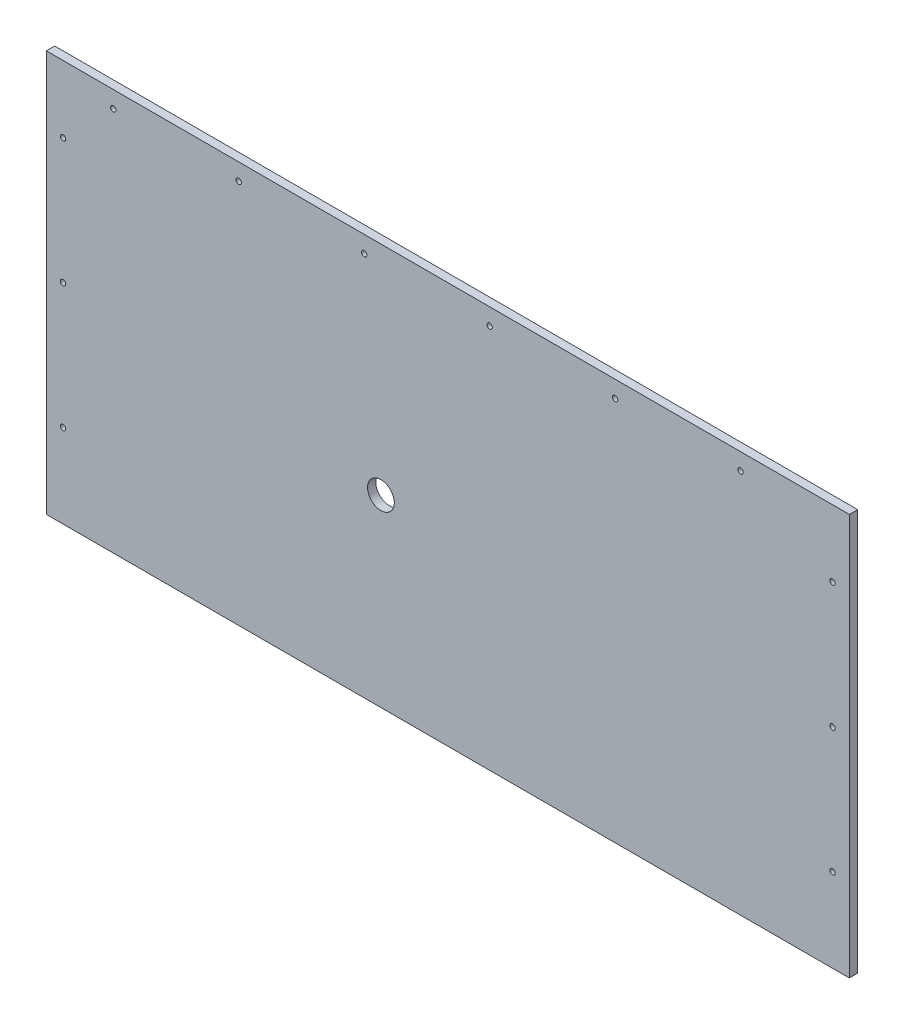
ISO-10303-21;
HEADER;
FILE_DESCRIPTION(('STEP AP214'),'2;1');
FILE_NAME('part.step','',(''),(''),'','','');
FILE_SCHEMA(('AUTOMOTIVE_DESIGN { 1 0 10303 214 1 1 1 1 }'));
ENDSEC;
DATA;
#1=APPLICATION_CONTEXT('core data for automotive mechanical design processes');
#2=APPLICATION_PROTOCOL_DEFINITION('international standard','automotive_design',2000,#1);
#3=PRODUCT_CONTEXT('',#1,'mechanical');
#4=PRODUCT('Part','Part','',(#3));
#5=PRODUCT_RELATED_PRODUCT_CATEGORY('part','',(#4));
#6=PRODUCT_DEFINITION_FORMATION('','',#4);
#7=PRODUCT_DEFINITION_CONTEXT('part definition',#1,'design');
#8=PRODUCT_DEFINITION('design','',#6,#7);
#9=PRODUCT_DEFINITION_SHAPE('','',#8);
#10=(LENGTH_UNIT() NAMED_UNIT(*) SI_UNIT(.MILLI.,.METRE.));
#11=(NAMED_UNIT(*) PLANE_ANGLE_UNIT() SI_UNIT($,.RADIAN.));
#12=(NAMED_UNIT(*) SI_UNIT($,.STERADIAN.) SOLID_ANGLE_UNIT());
#13=UNCERTAINTY_MEASURE_WITH_UNIT(LENGTH_MEASURE(1.E-05),#10,'distance_accuracy_value','');
#14=(GEOMETRIC_REPRESENTATION_CONTEXT(3) GLOBAL_UNCERTAINTY_ASSIGNED_CONTEXT((#13)) GLOBAL_UNIT_ASSIGNED_CONTEXT((#10,
#11,#12)) REPRESENTATION_CONTEXT('',''));
#15=CARTESIAN_POINT('',(0.,0.,0.));
#16=DIRECTION('',(0.,0.,1.));
#17=DIRECTION('',(1.,0.,0.));
#18=AXIS2_PLACEMENT_3D('',#15,#16,#17);
#19=CARTESIAN_POINT('',(0.,0.,6.35));
#20=DIRECTION('',(0.,0.,1.));
#21=DIRECTION('',(1.,0.,0.));
#22=AXIS2_PLACEMENT_3D('',#19,#20,#21);
#23=PLANE('',#22);
#24=CARTESIAN_POINT('',(254.,139.7,6.35));
#25=DIRECTION('',(0.,0.,-1.));
#26=DIRECTION('',(-1.,0.,0.));
#27=AXIS2_PLACEMENT_3D('',#24,#25,#26);
#28=CIRCLE('',#27,10.16);
#29=CARTESIAN_POINT('',(243.84,139.7,6.35));
#30=VERTEX_POINT('',#29);
#31=EDGE_CURVE('E154',#30,#30,#28,.T.);
#32=ORIENTED_EDGE('',*,*,#31,.T.);
#33=EDGE_LOOP('',(#32));
#34=FACE_BOUND('',#33,.T.);
#35=CARTESIAN_POINT('',(50.8,292.1,6.35));
#36=DIRECTION('',(0.,0.,1.));
#37=DIRECTION('',(1.,0.,0.));
#38=AXIS2_PLACEMENT_3D('',#35,#36,#37);
#39=CIRCLE('',#38,2.03200000000001);
#40=CARTESIAN_POINT('',(52.832,292.1,6.35));
#41=VERTEX_POINT('',#40);
#42=EDGE_CURVE('E181',#41,#41,#39,.T.);
#43=ORIENTED_EDGE('',*,*,#42,.F.);
#44=EDGE_LOOP('',(#43));
#45=FACE_BOUND('',#44,.T.);
#46=CARTESIAN_POINT('',(146.05,292.1,6.35));
#47=DIRECTION('',(0.,0.,1.));
#48=DIRECTION('',(1.,0.,0.));
#49=AXIS2_PLACEMENT_3D('',#46,#47,#48);
#50=CIRCLE('',#49,2.03200000000001);
#51=CARTESIAN_POINT('',(148.082,292.1,6.35));
#52=VERTEX_POINT('',#51);
#53=EDGE_CURVE('E175',#52,#52,#50,.T.);
#54=ORIENTED_EDGE('',*,*,#53,.F.);
#55=EDGE_LOOP('',(#54));
#56=FACE_BOUND('',#55,.T.);
#57=CARTESIAN_POINT('',(241.3,292.1,6.35));
#58=DIRECTION('',(0.,0.,1.));
#59=DIRECTION('',(1.,0.,0.));
#60=AXIS2_PLACEMENT_3D('',#57,#58,#59);
#61=CIRCLE('',#60,2.03199999999994);
#62=CARTESIAN_POINT('',(243.332,292.1,6.35));
#63=VERTEX_POINT('',#62);
#64=EDGE_CURVE('E169',#63,#63,#61,.T.);
#65=ORIENTED_EDGE('',*,*,#64,.F.);
#66=EDGE_LOOP('',(#65));
#67=FACE_BOUND('',#66,.T.);
#68=CARTESIAN_POINT('',(336.55,292.1,6.35));
#69=DIRECTION('',(0.,0.,1.));
#70=DIRECTION('',(1.,0.,0.));
#71=AXIS2_PLACEMENT_3D('',#68,#69,#70);
#72=CIRCLE('',#71,2.03199999999996);
#73=CARTESIAN_POINT('',(338.582,292.1,6.35));
#74=VERTEX_POINT('',#73);
#75=EDGE_CURVE('E163',#74,#74,#72,.T.);
#76=ORIENTED_EDGE('',*,*,#75,.F.);
#77=EDGE_LOOP('',(#76));
#78=FACE_BOUND('',#77,.T.);
#79=CARTESIAN_POINT('',(431.8,292.1,6.35));
#80=DIRECTION('',(0.,0.,1.));
#81=DIRECTION('',(1.,0.,0.));
#82=AXIS2_PLACEMENT_3D('',#79,#80,#81);
#83=CIRCLE('',#82,2.03199999999996);
#84=CARTESIAN_POINT('',(433.832,292.1,6.35));
#85=VERTEX_POINT('',#84);
#86=EDGE_CURVE('E157',#85,#85,#83,.T.);
#87=ORIENTED_EDGE('',*,*,#86,.F.);
#88=EDGE_LOOP('',(#87));
#89=FACE_BOUND('',#88,.T.);
#90=CARTESIAN_POINT('',(527.05,292.1,6.35));
#91=DIRECTION('',(0.,0.,1.));
#92=DIRECTION('',(1.,0.,0.));
#93=AXIS2_PLACEMENT_3D('',#90,#91,#92);
#94=CIRCLE('',#93,2.03200000000001);
#95=CARTESIAN_POINT('',(529.082,292.1,6.35));
#96=VERTEX_POINT('',#95);
#97=EDGE_CURVE('E150',#96,#96,#94,.T.);
#98=ORIENTED_EDGE('',*,*,#97,.F.);
#99=EDGE_LOOP('',(#98));
#100=FACE_BOUND('',#99,.T.);
#101=CARTESIAN_POINT('',(596.899999999999,158.75,6.35));
#102=DIRECTION('',(0.,0.,-1.));
#103=DIRECTION('',(-1.,0.,0.));
#104=AXIS2_PLACEMENT_3D('',#101,#102,#103);
#105=CIRCLE('',#104,2.03200000000001);
#106=CARTESIAN_POINT('',(594.867999999999,158.75,6.35));
#107=VERTEX_POINT('',#106);
#108=EDGE_CURVE('E130',#107,#107,#105,.T.);
#109=ORIENTED_EDGE('',*,*,#108,.T.);
#110=EDGE_LOOP('',(#109));
#111=FACE_BOUND('',#110,.T.);
#112=DIRECTION('',(1.,0.,0.));
#113=VECTOR('',#112,1.);
#114=CARTESIAN_POINT('',(0.,0.,6.35));
#115=LINE('',#114,#113);
#116=CARTESIAN_POINT('',(0.,0.,6.35));
#117=VERTEX_POINT('',#116);
#118=CARTESIAN_POINT('',(609.6,0.,6.35));
#119=VERTEX_POINT('',#118);
#120=EDGE_CURVE('E88',#117,#119,#115,.T.);
#121=ORIENTED_EDGE('',*,*,#120,.T.);
#122=DIRECTION('',(0.,1.,0.));
#123=VECTOR('',#122,1.);
#124=CARTESIAN_POINT('',(609.6,0.,6.35));
#125=LINE('',#124,#123);
#126=CARTESIAN_POINT('',(609.6,304.8,6.35));
#127=VERTEX_POINT('',#126);
#128=EDGE_CURVE('E80',#119,#127,#125,.T.);
#129=ORIENTED_EDGE('',*,*,#128,.T.);
#130=DIRECTION('',(1.,0.,0.));
#131=VECTOR('',#130,1.);
#132=CARTESIAN_POINT('',(0.,304.8,6.35));
#133=LINE('',#132,#131);
#134=CARTESIAN_POINT('',(0.,304.8,6.35));
#135=VERTEX_POINT('',#134);
#136=EDGE_CURVE('E87',#135,#127,#133,.T.);
#137=ORIENTED_EDGE('',*,*,#136,.F.);
#138=DIRECTION('',(0.,1.,0.));
#139=VECTOR('',#138,1.);
#140=CARTESIAN_POINT('',(0.,0.,6.35));
#141=LINE('',#140,#139);
#142=EDGE_CURVE('E97',#117,#135,#141,.T.);
#143=ORIENTED_EDGE('',*,*,#142,.F.);
#144=EDGE_LOOP('',(#121,#129,#137,#143));
#145=FACE_BOUND('',#144,.T.);
#146=CARTESIAN_POINT('',(12.7,254.,6.35));
#147=DIRECTION('',(0.,0.,1.));
#148=DIRECTION('',(1.,0.,0.));
#149=AXIS2_PLACEMENT_3D('',#146,#147,#148);
#150=CIRCLE('',#149,2.03200000000001);
#151=CARTESIAN_POINT('',(14.732,254.,6.35));
#152=VERTEX_POINT('',#151);
#153=EDGE_CURVE('E114',#152,#152,#150,.T.);
#154=ORIENTED_EDGE('',*,*,#153,.F.);
#155=EDGE_LOOP('',(#154));
#156=FACE_BOUND('',#155,.T.);
#157=CARTESIAN_POINT('',(12.700000000001,158.75,6.35));
#158=DIRECTION('',(0.,0.,1.));
#159=DIRECTION('',(1.,0.,0.));
#160=AXIS2_PLACEMENT_3D('',#157,#158,#159);
#161=CIRCLE('',#160,2.03199999999999);
#162=CARTESIAN_POINT('',(14.732000000001,158.75,6.35));
#163=VERTEX_POINT('',#162);
#164=EDGE_CURVE('E117',#163,#163,#161,.T.);
#165=ORIENTED_EDGE('',*,*,#164,.F.);
#166=EDGE_LOOP('',(#165));
#167=FACE_BOUND('',#166,.T.);
#168=CARTESIAN_POINT('',(12.700000000002,63.5,6.35));
#169=DIRECTION('',(0.,0.,1.));
#170=DIRECTION('',(1.,0.,0.));
#171=AXIS2_PLACEMENT_3D('',#168,#169,#170);
#172=CIRCLE('',#171,2.032);
#173=CARTESIAN_POINT('',(14.732000000002,63.5,6.35));
#174=VERTEX_POINT('',#173);
#175=EDGE_CURVE('E142',#174,#174,#172,.T.);
#176=ORIENTED_EDGE('',*,*,#175,.F.);
#177=EDGE_LOOP('',(#176));
#178=FACE_BOUND('',#177,.T.);
#179=CARTESIAN_POINT('',(596.899999999998,63.5000000000001,6.35));
#180=DIRECTION('',(0.,0.,-1.));
#181=DIRECTION('',(-1.,0.,0.));
#182=AXIS2_PLACEMENT_3D('',#179,#180,#181);
#183=CIRCLE('',#182,2.03200000000013);
#184=CARTESIAN_POINT('',(594.867999999998,63.5000000000001,6.35));
#185=VERTEX_POINT('',#184);
#186=EDGE_CURVE('E136',#185,#185,#183,.T.);
#187=ORIENTED_EDGE('',*,*,#186,.T.);
#188=EDGE_LOOP('',(#187));
#189=FACE_BOUND('',#188,.T.);
#190=CARTESIAN_POINT('',(596.9,254.,6.35));
#191=DIRECTION('',(0.,0.,-1.));
#192=DIRECTION('',(-1.,0.,0.));
#193=AXIS2_PLACEMENT_3D('',#190,#191,#192);
#194=CIRCLE('',#193,2.03200000000001);
#195=CARTESIAN_POINT('',(594.868,254.,6.35));
#196=VERTEX_POINT('',#195);
#197=EDGE_CURVE('E123',#196,#196,#194,.T.);
#198=ORIENTED_EDGE('',*,*,#197,.T.);
#199=EDGE_LOOP('',(#198));
#200=FACE_BOUND('',#199,.T.);
#201=ADVANCED_FACE('F38',(#34,#45,#56,#67,#78,#89,#100,#111,#145,#156,#167,#178,#189,#200),#23,.T.);
#202=CARTESIAN_POINT('',(0.,0.,0.));
#203=DIRECTION('',(0.,0.,1.));
#204=DIRECTION('',(1.,0.,0.));
#205=AXIS2_PLACEMENT_3D('',#202,#203,#204);
#206=PLANE('',#205);
#207=CARTESIAN_POINT('',(254.,139.7,0.));
#208=DIRECTION('',(0.,0.,-1.));
#209=DIRECTION('',(-1.,0.,0.));
#210=AXIS2_PLACEMENT_3D('',#207,#208,#209);
#211=CIRCLE('',#210,10.16);
#212=CARTESIAN_POINT('',(243.84,139.7,0.));
#213=VERTEX_POINT('',#212);
#214=EDGE_CURVE('E186',#213,#213,#211,.T.);
#215=ORIENTED_EDGE('',*,*,#214,.F.);
#216=EDGE_LOOP('',(#215));
#217=FACE_BOUND('',#216,.T.);
#218=CARTESIAN_POINT('',(50.8,292.1,0.));
#219=DIRECTION('',(0.,0.,1.));
#220=DIRECTION('',(1.,0.,0.));
#221=AXIS2_PLACEMENT_3D('',#218,#219,#220);
#222=CIRCLE('',#221,2.03200000000001);
#223=CARTESIAN_POINT('',(52.832,292.1,0.));
#224=VERTEX_POINT('',#223);
#225=EDGE_CURVE('E124',#224,#224,#222,.T.);
#226=ORIENTED_EDGE('',*,*,#225,.T.);
#227=EDGE_LOOP('',(#226));
#228=FACE_BOUND('',#227,.T.);
#229=CARTESIAN_POINT('',(146.05,292.1,0.));
#230=DIRECTION('',(0.,0.,1.));
#231=DIRECTION('',(1.,0.,0.));
#232=AXIS2_PLACEMENT_3D('',#229,#230,#231);
#233=CIRCLE('',#232,2.03200000000001);
#234=CARTESIAN_POINT('',(148.082,292.1,0.));
#235=VERTEX_POINT('',#234);
#236=EDGE_CURVE('E178',#235,#235,#233,.T.);
#237=ORIENTED_EDGE('',*,*,#236,.T.);
#238=EDGE_LOOP('',(#237));
#239=FACE_BOUND('',#238,.T.);
#240=CARTESIAN_POINT('',(241.3,292.1,0.));
#241=DIRECTION('',(0.,0.,1.));
#242=DIRECTION('',(1.,0.,0.));
#243=AXIS2_PLACEMENT_3D('',#240,#241,#242);
#244=CIRCLE('',#243,2.03199999999994);
#245=CARTESIAN_POINT('',(243.332,292.1,0.));
#246=VERTEX_POINT('',#245);
#247=EDGE_CURVE('E172',#246,#246,#244,.T.);
#248=ORIENTED_EDGE('',*,*,#247,.T.);
#249=EDGE_LOOP('',(#248));
#250=FACE_BOUND('',#249,.T.);
#251=CARTESIAN_POINT('',(336.55,292.1,0.));
#252=DIRECTION('',(0.,0.,1.));
#253=DIRECTION('',(1.,0.,0.));
#254=AXIS2_PLACEMENT_3D('',#251,#252,#253);
#255=CIRCLE('',#254,2.03199999999996);
#256=CARTESIAN_POINT('',(338.582,292.1,0.));
#257=VERTEX_POINT('',#256);
#258=EDGE_CURVE('E166',#257,#257,#255,.T.);
#259=ORIENTED_EDGE('',*,*,#258,.T.);
#260=EDGE_LOOP('',(#259));
#261=FACE_BOUND('',#260,.T.);
#262=CARTESIAN_POINT('',(431.8,292.1,0.));
#263=DIRECTION('',(0.,0.,1.));
#264=DIRECTION('',(1.,0.,0.));
#265=AXIS2_PLACEMENT_3D('',#262,#263,#264);
#266=CIRCLE('',#265,2.03199999999996);
#267=CARTESIAN_POINT('',(433.832,292.1,0.));
#268=VERTEX_POINT('',#267);
#269=EDGE_CURVE('E160',#268,#268,#266,.T.);
#270=ORIENTED_EDGE('',*,*,#269,.T.);
#271=EDGE_LOOP('',(#270));
#272=FACE_BOUND('',#271,.T.);
#273=CARTESIAN_POINT('',(527.05,292.1,0.));
#274=DIRECTION('',(0.,0.,1.));
#275=DIRECTION('',(1.,0.,0.));
#276=AXIS2_PLACEMENT_3D('',#273,#274,#275);
#277=CIRCLE('',#276,2.03200000000001);
#278=CARTESIAN_POINT('',(529.082,292.1,0.));
#279=VERTEX_POINT('',#278);
#280=EDGE_CURVE('E153',#279,#279,#277,.T.);
#281=ORIENTED_EDGE('',*,*,#280,.T.);
#282=EDGE_LOOP('',(#281));
#283=FACE_BOUND('',#282,.T.);
#284=CARTESIAN_POINT('',(12.700000000002,63.5,0.));
#285=DIRECTION('',(0.,0.,1.));
#286=DIRECTION('',(1.,0.,0.));
#287=AXIS2_PLACEMENT_3D('',#284,#285,#286);
#288=CIRCLE('',#287,2.032);
#289=CARTESIAN_POINT('',(14.732000000002,63.5,0.));
#290=VERTEX_POINT('',#289);
#291=EDGE_CURVE('E139',#290,#290,#288,.T.);
#292=ORIENTED_EDGE('',*,*,#291,.T.);
#293=EDGE_LOOP('',(#292));
#294=FACE_BOUND('',#293,.T.);
#295=CARTESIAN_POINT('',(12.700000000001,158.75,0.));
#296=DIRECTION('',(0.,0.,1.));
#297=DIRECTION('',(1.,0.,0.));
#298=AXIS2_PLACEMENT_3D('',#295,#296,#297);
#299=CIRCLE('',#298,2.03199999999999);
#300=CARTESIAN_POINT('',(14.732000000001,158.75,0.));
#301=VERTEX_POINT('',#300);
#302=EDGE_CURVE('E145',#301,#301,#299,.T.);
#303=ORIENTED_EDGE('',*,*,#302,.T.);
#304=EDGE_LOOP('',(#303));
#305=FACE_BOUND('',#304,.T.);
#306=CARTESIAN_POINT('',(12.7,254.,0.));
#307=DIRECTION('',(0.,0.,1.));
#308=DIRECTION('',(1.,0.,0.));
#309=AXIS2_PLACEMENT_3D('',#306,#307,#308);
#310=CIRCLE('',#309,2.03200000000001);
#311=CARTESIAN_POINT('',(14.732,254.,0.));
#312=VERTEX_POINT('',#311);
#313=EDGE_CURVE('E104',#312,#312,#310,.T.);
#314=ORIENTED_EDGE('',*,*,#313,.T.);
#315=EDGE_LOOP('',(#314));
#316=FACE_BOUND('',#315,.T.);
#317=DIRECTION('',(1.,0.,0.));
#318=VECTOR('',#317,1.);
#319=CARTESIAN_POINT('',(0.,0.,0.));
#320=LINE('',#319,#318);
#321=CARTESIAN_POINT('',(0.,0.,0.));
#322=VERTEX_POINT('',#321);
#323=CARTESIAN_POINT('',(609.6,0.,0.));
#324=VERTEX_POINT('',#323);
#325=EDGE_CURVE('E102',#322,#324,#320,.T.);
#326=ORIENTED_EDGE('',*,*,#325,.F.);
#327=DIRECTION('',(0.,1.,0.));
#328=VECTOR('',#327,1.);
#329=CARTESIAN_POINT('',(0.,0.,0.));
#330=LINE('',#329,#328);
#331=CARTESIAN_POINT('',(0.,304.8,0.));
#332=VERTEX_POINT('',#331);
#333=EDGE_CURVE('E108',#322,#332,#330,.T.);
#334=ORIENTED_EDGE('',*,*,#333,.T.);
#335=DIRECTION('',(1.,0.,0.));
#336=VECTOR('',#335,1.);
#337=CARTESIAN_POINT('',(0.,304.8,0.));
#338=LINE('',#337,#336);
#339=CARTESIAN_POINT('',(609.6,304.8,0.));
#340=VERTEX_POINT('',#339);
#341=EDGE_CURVE('E106',#332,#340,#338,.T.);
#342=ORIENTED_EDGE('',*,*,#341,.T.);
#343=DIRECTION('',(0.,1.,0.));
#344=VECTOR('',#343,1.);
#345=CARTESIAN_POINT('',(609.6,0.,0.));
#346=LINE('',#345,#344);
#347=EDGE_CURVE('E93',#324,#340,#346,.T.);
#348=ORIENTED_EDGE('',*,*,#347,.F.);
#349=EDGE_LOOP('',(#326,#334,#342,#348));
#350=FACE_BOUND('',#349,.T.);
#351=CARTESIAN_POINT('',(596.899999999998,63.5000000000001,0.));
#352=DIRECTION('',(0.,0.,-1.));
#353=DIRECTION('',(-1.,0.,0.));
#354=AXIS2_PLACEMENT_3D('',#351,#352,#353);
#355=CIRCLE('',#354,2.03200000000013);
#356=CARTESIAN_POINT('',(594.867999999998,63.5000000000001,0.));
#357=VERTEX_POINT('',#356);
#358=EDGE_CURVE('E133',#357,#357,#355,.T.);
#359=ORIENTED_EDGE('',*,*,#358,.F.);
#360=EDGE_LOOP('',(#359));
#361=FACE_BOUND('',#360,.T.);
#362=CARTESIAN_POINT('',(596.899999999999,158.75,0.));
#363=DIRECTION('',(0.,0.,-1.));
#364=DIRECTION('',(-1.,0.,0.));
#365=AXIS2_PLACEMENT_3D('',#362,#363,#364);
#366=CIRCLE('',#365,2.03200000000001);
#367=CARTESIAN_POINT('',(594.867999999999,158.75,0.));
#368=VERTEX_POINT('',#367);
#369=EDGE_CURVE('E127',#368,#368,#366,.T.);
#370=ORIENTED_EDGE('',*,*,#369,.F.);
#371=EDGE_LOOP('',(#370));
#372=FACE_BOUND('',#371,.T.);
#373=CARTESIAN_POINT('',(596.9,254.,0.));
#374=DIRECTION('',(0.,0.,-1.));
#375=DIRECTION('',(-1.,0.,0.));
#376=AXIS2_PLACEMENT_3D('',#373,#374,#375);
#377=CIRCLE('',#376,2.03200000000001);
#378=CARTESIAN_POINT('',(594.868,254.,0.));
#379=VERTEX_POINT('',#378);
#380=EDGE_CURVE('E120',#379,#379,#377,.T.);
#381=ORIENTED_EDGE('',*,*,#380,.F.);
#382=EDGE_LOOP('',(#381));
#383=FACE_BOUND('',#382,.T.);
#384=ADVANCED_FACE('F201',(#217,#228,#239,#250,#261,#272,#283,#294,#305,#316,#350,#361,#372,
#383),#206,.F.);
#385=CARTESIAN_POINT('',(0.,0.,6.35));
#386=DIRECTION('',(0.,1.,0.));
#387=DIRECTION('',(0.,0.,1.));
#388=AXIS2_PLACEMENT_3D('',#385,#386,#387);
#389=PLANE('',#388);
#390=ORIENTED_EDGE('',*,*,#325,.T.);
#391=DIRECTION('',(0.,0.,-1.));
#392=VECTOR('',#391,1.);
#393=CARTESIAN_POINT('',(609.6,0.,6.35));
#394=LINE('',#393,#392);
#395=EDGE_CURVE('E11',#119,#324,#394,.T.);
#396=ORIENTED_EDGE('',*,*,#395,.F.);
#397=ORIENTED_EDGE('',*,*,#120,.F.);
#398=DIRECTION('',(0.,0.,-1.));
#399=VECTOR('',#398,1.);
#400=CARTESIAN_POINT('',(0.,0.,6.35));
#401=LINE('',#400,#399);
#402=EDGE_CURVE('E55',#117,#322,#401,.T.);
#403=ORIENTED_EDGE('',*,*,#402,.T.);
#404=EDGE_LOOP('',(#390,#396,#397,#403));
#405=FACE_BOUND('',#404,.T.);
#406=ADVANCED_FACE('F40',(#405),#389,.F.);
#407=CARTESIAN_POINT('',(609.6,0.,6.35));
#408=DIRECTION('',(-1.,0.,0.));
#409=DIRECTION('',(0.,0.,1.));
#410=AXIS2_PLACEMENT_3D('',#407,#408,#409);
#411=PLANE('',#410);
#412=ORIENTED_EDGE('',*,*,#347,.T.);
#413=DIRECTION('',(0.,0.,-1.));
#414=VECTOR('',#413,1.);
#415=CARTESIAN_POINT('',(609.6,304.8,6.35));
#416=LINE('',#415,#414);
#417=EDGE_CURVE('E47',#127,#340,#416,.T.);
#418=ORIENTED_EDGE('',*,*,#417,.F.);
#419=ORIENTED_EDGE('',*,*,#128,.F.);
#420=ORIENTED_EDGE('',*,*,#395,.T.);
#421=EDGE_LOOP('',(#412,#418,#419,#420));
#422=FACE_BOUND('',#421,.T.);
#423=ADVANCED_FACE('F92',(#422),#411,.F.);
#424=CARTESIAN_POINT('',(0.,304.8,6.35));
#425=DIRECTION('',(0.,1.,0.));
#426=DIRECTION('',(0.,0.,1.));
#427=AXIS2_PLACEMENT_3D('',#424,#425,#426);
#428=PLANE('',#427);
#429=ORIENTED_EDGE('',*,*,#341,.F.);
#430=DIRECTION('',(0.,0.,-1.));
#431=VECTOR('',#430,1.);
#432=CARTESIAN_POINT('',(0.,304.8,6.35));
#433=LINE('',#432,#431);
#434=EDGE_CURVE('E69',#135,#332,#433,.T.);
#435=ORIENTED_EDGE('',*,*,#434,.F.);
#436=ORIENTED_EDGE('',*,*,#136,.T.);
#437=ORIENTED_EDGE('',*,*,#417,.T.);
#438=EDGE_LOOP('',(#429,#435,#436,#437));
#439=FACE_BOUND('',#438,.T.);
#440=ADVANCED_FACE('F96',(#439),#428,.T.);
#441=CARTESIAN_POINT('',(0.,0.,6.35));
#442=DIRECTION('',(-1.,0.,0.));
#443=DIRECTION('',(0.,0.,1.));
#444=AXIS2_PLACEMENT_3D('',#441,#442,#443);
#445=PLANE('',#444);
#446=ORIENTED_EDGE('',*,*,#333,.F.);
#447=ORIENTED_EDGE('',*,*,#402,.F.);
#448=ORIENTED_EDGE('',*,*,#142,.T.);
#449=ORIENTED_EDGE('',*,*,#434,.T.);
#450=EDGE_LOOP('',(#446,#447,#448,#449));
#451=FACE_BOUND('',#450,.T.);
#452=ADVANCED_FACE('F244',(#451),#445,.T.);
#453=CARTESIAN_POINT('',(12.7,254.,0.));
#454=DIRECTION('',(0.,0.,1.));
#455=DIRECTION('',(1.,0.,0.));
#456=AXIS2_PLACEMENT_3D('',#453,#454,#455);
#457=CYLINDRICAL_SURFACE('',#456,2.03200000000001);
#458=ORIENTED_EDGE('',*,*,#313,.F.);
#459=EDGE_LOOP('',(#458));
#460=FACE_BOUND('',#459,.T.);
#461=ORIENTED_EDGE('',*,*,#153,.T.);
#462=EDGE_LOOP('',(#461));
#463=FACE_BOUND('',#462,.T.);
#464=ADVANCED_FACE('F242',(#460,#463),#457,.F.);
#465=CARTESIAN_POINT('',(12.700000000001,158.75,0.));
#466=DIRECTION('',(0.,0.,1.));
#467=DIRECTION('',(1.,0.,0.));
#468=AXIS2_PLACEMENT_3D('',#465,#466,#467);
#469=CYLINDRICAL_SURFACE('',#468,2.03199999999999);
#470=ORIENTED_EDGE('',*,*,#302,.F.);
#471=EDGE_LOOP('',(#470));
#472=FACE_BOUND('',#471,.T.);
#473=ORIENTED_EDGE('',*,*,#164,.T.);
#474=EDGE_LOOP('',(#473));
#475=FACE_BOUND('',#474,.T.);
#476=ADVANCED_FACE('F341',(#472,#475),#469,.F.);
#477=CARTESIAN_POINT('',(12.700000000002,63.5,0.));
#478=DIRECTION('',(0.,0.,1.));
#479=DIRECTION('',(1.,0.,0.));
#480=AXIS2_PLACEMENT_3D('',#477,#478,#479);
#481=CYLINDRICAL_SURFACE('',#480,2.032);
#482=ORIENTED_EDGE('',*,*,#291,.F.);
#483=EDGE_LOOP('',(#482));
#484=FACE_BOUND('',#483,.T.);
#485=ORIENTED_EDGE('',*,*,#175,.T.);
#486=EDGE_LOOP('',(#485));
#487=FACE_BOUND('',#486,.T.);
#488=ADVANCED_FACE('F333',(#484,#487),#481,.F.);
#489=CARTESIAN_POINT('',(596.899999999998,63.5000000000001,0.));
#490=DIRECTION('',(0.,0.,1.));
#491=DIRECTION('',(1.,0.,0.));
#492=AXIS2_PLACEMENT_3D('',#489,#490,#491);
#493=CYLINDRICAL_SURFACE('',#492,2.03200000000013);
#494=ORIENTED_EDGE('',*,*,#358,.T.);
#495=EDGE_LOOP('',(#494));
#496=FACE_BOUND('',#495,.T.);
#497=ORIENTED_EDGE('',*,*,#186,.F.);
#498=EDGE_LOOP('',(#497));
#499=FACE_BOUND('',#498,.T.);
#500=ADVANCED_FACE('F325',(#496,#499),#493,.F.);
#501=CARTESIAN_POINT('',(596.899999999999,158.75,0.));
#502=DIRECTION('',(0.,0.,1.));
#503=DIRECTION('',(1.,0.,0.));
#504=AXIS2_PLACEMENT_3D('',#501,#502,#503);
#505=CYLINDRICAL_SURFACE('',#504,2.03200000000001);
#506=ORIENTED_EDGE('',*,*,#369,.T.);
#507=EDGE_LOOP('',(#506));
#508=FACE_BOUND('',#507,.T.);
#509=ORIENTED_EDGE('',*,*,#108,.F.);
#510=EDGE_LOOP('',(#509));
#511=FACE_BOUND('',#510,.T.);
#512=ADVANCED_FACE('F233',(#508,#511),#505,.F.);
#513=CARTESIAN_POINT('',(596.9,254.,0.));
#514=DIRECTION('',(0.,0.,1.));
#515=DIRECTION('',(1.,0.,0.));
#516=AXIS2_PLACEMENT_3D('',#513,#514,#515);
#517=CYLINDRICAL_SURFACE('',#516,2.03200000000001);
#518=ORIENTED_EDGE('',*,*,#380,.T.);
#519=EDGE_LOOP('',(#518));
#520=FACE_BOUND('',#519,.T.);
#521=ORIENTED_EDGE('',*,*,#197,.F.);
#522=EDGE_LOOP('',(#521));
#523=FACE_BOUND('',#522,.T.);
#524=ADVANCED_FACE('F229',(#520,#523),#517,.F.);
#525=CARTESIAN_POINT('',(527.05,292.1,0.));
#526=DIRECTION('',(0.,0.,1.));
#527=DIRECTION('',(1.,0.,0.));
#528=AXIS2_PLACEMENT_3D('',#525,#526,#527);
#529=CYLINDRICAL_SURFACE('',#528,2.03200000000001);
#530=ORIENTED_EDGE('',*,*,#280,.F.);
#531=EDGE_LOOP('',(#530));
#532=FACE_BOUND('',#531,.T.);
#533=ORIENTED_EDGE('',*,*,#97,.T.);
#534=EDGE_LOOP('',(#533));
#535=FACE_BOUND('',#534,.T.);
#536=ADVANCED_FACE('F232',(#532,#535),#529,.F.);
#537=CARTESIAN_POINT('',(431.8,292.1,0.));
#538=DIRECTION('',(0.,0.,1.));
#539=DIRECTION('',(1.,0.,0.));
#540=AXIS2_PLACEMENT_3D('',#537,#538,#539);
#541=CYLINDRICAL_SURFACE('',#540,2.03199999999996);
#542=ORIENTED_EDGE('',*,*,#269,.F.);
#543=EDGE_LOOP('',(#542));
#544=FACE_BOUND('',#543,.T.);
#545=ORIENTED_EDGE('',*,*,#86,.T.);
#546=EDGE_LOOP('',(#545));
#547=FACE_BOUND('',#546,.T.);
#548=ADVANCED_FACE('F299',(#544,#547),#541,.F.);
#549=CARTESIAN_POINT('',(336.55,292.1,0.));
#550=DIRECTION('',(0.,0.,1.));
#551=DIRECTION('',(1.,0.,0.));
#552=AXIS2_PLACEMENT_3D('',#549,#550,#551);
#553=CYLINDRICAL_SURFACE('',#552,2.03199999999996);
#554=ORIENTED_EDGE('',*,*,#258,.F.);
#555=EDGE_LOOP('',(#554));
#556=FACE_BOUND('',#555,.T.);
#557=ORIENTED_EDGE('',*,*,#75,.T.);
#558=EDGE_LOOP('',(#557));
#559=FACE_BOUND('',#558,.T.);
#560=ADVANCED_FACE('F291',(#556,#559),#553,.F.);
#561=CARTESIAN_POINT('',(241.3,292.1,0.));
#562=DIRECTION('',(0.,0.,1.));
#563=DIRECTION('',(1.,0.,0.));
#564=AXIS2_PLACEMENT_3D('',#561,#562,#563);
#565=CYLINDRICAL_SURFACE('',#564,2.03199999999994);
#566=ORIENTED_EDGE('',*,*,#247,.F.);
#567=EDGE_LOOP('',(#566));
#568=FACE_BOUND('',#567,.T.);
#569=ORIENTED_EDGE('',*,*,#64,.T.);
#570=EDGE_LOOP('',(#569));
#571=FACE_BOUND('',#570,.T.);
#572=ADVANCED_FACE('F283',(#568,#571),#565,.F.);
#573=CARTESIAN_POINT('',(146.05,292.1,0.));
#574=DIRECTION('',(0.,0.,1.));
#575=DIRECTION('',(1.,0.,0.));
#576=AXIS2_PLACEMENT_3D('',#573,#574,#575);
#577=CYLINDRICAL_SURFACE('',#576,2.03200000000001);
#578=ORIENTED_EDGE('',*,*,#236,.F.);
#579=EDGE_LOOP('',(#578));
#580=FACE_BOUND('',#579,.T.);
#581=ORIENTED_EDGE('',*,*,#53,.T.);
#582=EDGE_LOOP('',(#581));
#583=FACE_BOUND('',#582,.T.);
#584=ADVANCED_FACE('F276',(#580,#583),#577,.F.);
#585=CARTESIAN_POINT('',(50.8,292.1,0.));
#586=DIRECTION('',(0.,0.,1.));
#587=DIRECTION('',(1.,0.,0.));
#588=AXIS2_PLACEMENT_3D('',#585,#586,#587);
#589=CYLINDRICAL_SURFACE('',#588,2.03200000000001);
#590=ORIENTED_EDGE('',*,*,#225,.F.);
#591=EDGE_LOOP('',(#590));
#592=FACE_BOUND('',#591,.T.);
#593=ORIENTED_EDGE('',*,*,#42,.T.);
#594=EDGE_LOOP('',(#593));
#595=FACE_BOUND('',#594,.T.);
#596=ADVANCED_FACE('F197',(#592,#595),#589,.F.);
#597=CARTESIAN_POINT('',(254.,139.7,6.35));
#598=DIRECTION('',(0.,0.,-1.));
#599=DIRECTION('',(-1.,0.,0.));
#600=AXIS2_PLACEMENT_3D('',#597,#598,#599);
#601=CYLINDRICAL_SURFACE('',#600,10.16);
#602=ORIENTED_EDGE('',*,*,#31,.F.);
#603=EDGE_LOOP('',(#602));
#604=FACE_BOUND('',#603,.T.);
#605=ORIENTED_EDGE('',*,*,#214,.T.);
#606=EDGE_LOOP('',(#605));
#607=FACE_BOUND('',#606,.T.);
#608=ADVANCED_FACE('F194',(#604,#607),#601,.F.);
#609=CLOSED_SHELL('',(#201,#384,#406,#423,#440,#452,#464,#476,#488,#500,#512,#524,#536,#548,
#560,#572,#584,#596,#608));
#610=MANIFOLD_SOLID_BREP('B2',#609);
#611=ADVANCED_BREP_SHAPE_REPRESENTATION('',(#18,#610),#14);
#612=SHAPE_DEFINITION_REPRESENTATION(#9,#611);
ENDSEC;
END-ISO-10303-21;
